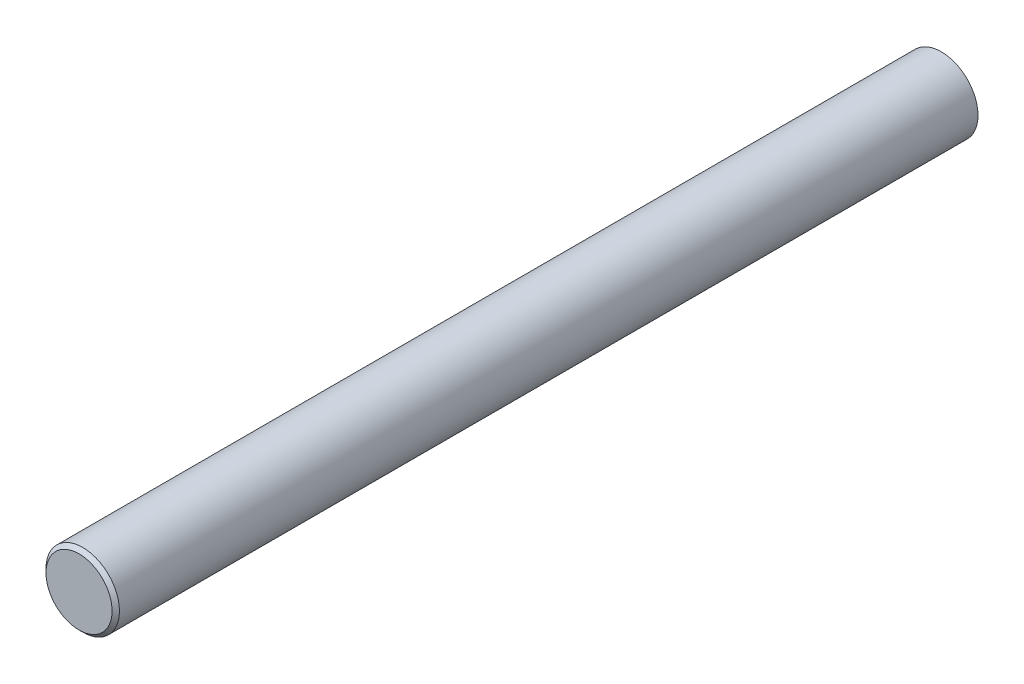
ISO-10303-21;
HEADER;
FILE_DESCRIPTION(('STEP AP214'),'2;1');
FILE_NAME('part.step','',(''),(''),'','','');
FILE_SCHEMA(('AUTOMOTIVE_DESIGN { 1 0 10303 214 1 1 1 1 }'));
ENDSEC;
DATA;
#1=APPLICATION_CONTEXT('core data for automotive mechanical design processes');
#2=APPLICATION_PROTOCOL_DEFINITION('international standard','automotive_design',2000,#1);
#3=PRODUCT_CONTEXT('',#1,'mechanical');
#4=PRODUCT('Part','Part','',(#3));
#5=PRODUCT_RELATED_PRODUCT_CATEGORY('part','',(#4));
#6=PRODUCT_DEFINITION_FORMATION('','',#4);
#7=PRODUCT_DEFINITION_CONTEXT('part definition',#1,'design');
#8=PRODUCT_DEFINITION('design','',#6,#7);
#9=PRODUCT_DEFINITION_SHAPE('','',#8);
#10=(LENGTH_UNIT() NAMED_UNIT(*) SI_UNIT(.MILLI.,.METRE.));
#11=(NAMED_UNIT(*) PLANE_ANGLE_UNIT() SI_UNIT($,.RADIAN.));
#12=(NAMED_UNIT(*) SI_UNIT($,.STERADIAN.) SOLID_ANGLE_UNIT());
#13=UNCERTAINTY_MEASURE_WITH_UNIT(LENGTH_MEASURE(1.E-05),#10,'distance_accuracy_value','');
#14=(GEOMETRIC_REPRESENTATION_CONTEXT(3) GLOBAL_UNCERTAINTY_ASSIGNED_CONTEXT((#13)) GLOBAL_UNIT_ASSIGNED_CONTEXT((#10,
#11,#12)) REPRESENTATION_CONTEXT('',''));
#15=CARTESIAN_POINT('',(0.,0.,0.));
#16=DIRECTION('',(0.,0.,1.));
#17=DIRECTION('',(1.,0.,0.));
#18=AXIS2_PLACEMENT_3D('',#15,#16,#17);
#19=CARTESIAN_POINT('',(0.,0.,1001.5875));
#20=DIRECTION('',(0.,0.,1.));
#21=DIRECTION('',(1.,0.,0.));
#22=AXIS2_PLACEMENT_3D('',#19,#20,#21);
#23=PLANE('',#22);
#24=CARTESIAN_POINT('',(0.,0.,1001.5875));
#25=DIRECTION('',(0.,0.,1.));
#26=DIRECTION('',(1.,0.,0.));
#27=AXIS2_PLACEMENT_3D('',#24,#25,#26);
#28=CIRCLE('',#27,43.23);
#29=CARTESIAN_POINT('',(43.23,0.,1001.5875));
#30=VERTEX_POINT('',#29);
#31=EDGE_CURVE('E18',#30,#30,#28,.F.);
#32=ORIENTED_EDGE('',*,*,#31,.T.);
#33=EDGE_LOOP('',(#32));
#34=FACE_BOUND('',#33,.T.);
#35=ADVANCED_FACE('F15',(#34),#23,.F.);
#36=CARTESIAN_POINT('',(0.,0.,0.));
#37=DIRECTION('',(0.,0.,1.));
#38=DIRECTION('',(1.,0.,0.));
#39=AXIS2_PLACEMENT_3D('',#36,#37,#38);
#40=CYLINDRICAL_SURFACE('',#39,43.23);
#41=CARTESIAN_POINT('',(0.,0.,0.));
#42=DIRECTION('',(0.,0.,1.));
#43=DIRECTION('',(1.,0.,0.));
#44=AXIS2_PLACEMENT_3D('',#41,#42,#43);
#45=CIRCLE('',#44,43.23);
#46=CARTESIAN_POINT('',(43.23,0.,0.));
#47=VERTEX_POINT('',#46);
#48=EDGE_CURVE('E31',#47,#47,#45,.F.);
#49=ORIENTED_EDGE('',*,*,#48,.T.);
#50=EDGE_LOOP('',(#49));
#51=FACE_BOUND('',#50,.T.);
#52=ORIENTED_EDGE('',*,*,#31,.F.);
#53=EDGE_LOOP('',(#52));
#54=FACE_BOUND('',#53,.T.);
#55=ADVANCED_FACE('F39',(#51,#54),#40,.F.);
#56=CARTESIAN_POINT('',(0.,40.05,1045.));
#57=DIRECTION('',(0.,0.,-1.));
#58=DIRECTION('',(-1.,0.,0.));
#59=AXIS2_PLACEMENT_3D('',#56,#57,#58);
#60=PLANE('',#59);
#61=CARTESIAN_POINT('',(0.,0.,1045.));
#62=DIRECTION('',(0.,0.,-1.));
#63=DIRECTION('',(-1.,0.,0.));
#64=AXIS2_PLACEMENT_3D('',#61,#62,#63);
#65=CIRCLE('',#64,40.05);
#66=CARTESIAN_POINT('',(-40.05,0.,1045.));
#67=VERTEX_POINT('',#66);
#68=EDGE_CURVE('E27',#67,#67,#65,.T.);
#69=ORIENTED_EDGE('',*,*,#68,.F.);
#70=EDGE_LOOP('',(#69));
#71=FACE_BOUND('',#70,.T.);
#72=ADVANCED_FACE('F41',(#71),#60,.F.);
#73=CARTESIAN_POINT('',(0.,43.23,0.));
#74=DIRECTION('',(0.,0.,1.));
#75=DIRECTION('',(1.,0.,0.));
#76=AXIS2_PLACEMENT_3D('',#73,#74,#75);
#77=PLANE('',#76);
#78=ORIENTED_EDGE('',*,*,#48,.F.);
#79=EDGE_LOOP('',(#78));
#80=FACE_BOUND('',#79,.T.);
#81=CARTESIAN_POINT('',(0.,0.,0.));
#82=DIRECTION('',(0.,0.,1.));
#83=DIRECTION('',(1.,0.,0.));
#84=AXIS2_PLACEMENT_3D('',#81,#82,#83);
#85=CIRCLE('',#84,44.4999999999999);
#86=CARTESIAN_POINT('',(44.4999999999999,0.,0.));
#87=VERTEX_POINT('',#86);
#88=EDGE_CURVE('E22',#87,#87,#85,.T.);
#89=ORIENTED_EDGE('',*,*,#88,.F.);
#90=EDGE_LOOP('',(#89));
#91=FACE_BOUND('',#90,.T.);
#92=ADVANCED_FACE('F47',(#80,#91),#77,.F.);
#93=CARTESIAN_POINT('',(0.,0.,1040.55));
#94=DIRECTION('',(0.,0.,-1.));
#95=DIRECTION('',(-1.,0.,0.));
#96=AXIS2_PLACEMENT_3D('',#93,#94,#95);
#97=CONICAL_SURFACE('',#96,44.4999999999999,0.78539816339743);
#98=CARTESIAN_POINT('',(0.,0.,1040.55));
#99=DIRECTION('',(0.,0.,1.));
#100=DIRECTION('',(1.,0.,0.));
#101=AXIS2_PLACEMENT_3D('',#98,#99,#100);
#102=CIRCLE('',#101,44.4999999999999);
#103=CARTESIAN_POINT('',(44.4999999999999,0.,1040.55));
#104=VERTEX_POINT('',#103);
#105=EDGE_CURVE('E10',#104,#104,#102,.F.);
#106=ORIENTED_EDGE('',*,*,#105,.F.);
#107=EDGE_LOOP('',(#106));
#108=FACE_BOUND('',#107,.T.);
#109=ORIENTED_EDGE('',*,*,#68,.T.);
#110=EDGE_LOOP('',(#109));
#111=FACE_BOUND('',#110,.T.);
#112=ADVANCED_FACE('F52',(#108,#111),#97,.T.);
#113=CARTESIAN_POINT('',(0.,0.,0.));
#114=DIRECTION('',(0.,0.,1.));
#115=DIRECTION('',(1.,0.,0.));
#116=AXIS2_PLACEMENT_3D('',#113,#114,#115);
#117=CYLINDRICAL_SURFACE('',#116,44.4999999999999);
#118=ORIENTED_EDGE('',*,*,#105,.T.);
#119=EDGE_LOOP('',(#118));
#120=FACE_BOUND('',#119,.T.);
#121=ORIENTED_EDGE('',*,*,#88,.T.);
#122=EDGE_LOOP('',(#121));
#123=FACE_BOUND('',#122,.T.);
#124=ADVANCED_FACE('F50',(#120,#123),#117,.T.);
#125=CLOSED_SHELL('',(#35,#55,#72,#92,#112,#124));
#126=MANIFOLD_SOLID_BREP('B1',#125);
#127=ADVANCED_BREP_SHAPE_REPRESENTATION('',(#18,#126),#14);
#128=SHAPE_DEFINITION_REPRESENTATION(#9,#127);
ENDSEC;
END-ISO-10303-21;
